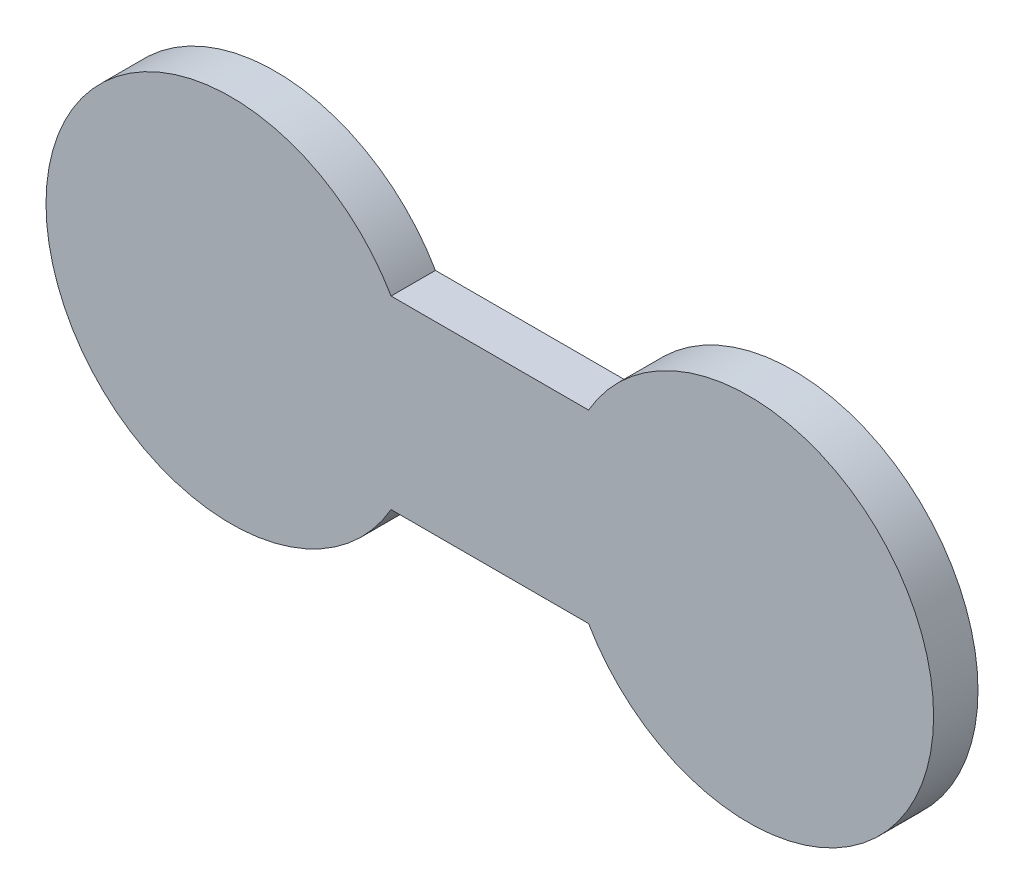
ISO-10303-21;
HEADER;
FILE_DESCRIPTION(('STEP AP214'),'2;1');
FILE_NAME('part.step','',(''),(''),'','','');
FILE_SCHEMA(('AUTOMOTIVE_DESIGN { 1 0 10303 214 1 1 1 1 }'));
ENDSEC;
DATA;
#1=APPLICATION_CONTEXT('core data for automotive mechanical design processes');
#2=APPLICATION_PROTOCOL_DEFINITION('international standard','automotive_design',2000,#1);
#3=PRODUCT_CONTEXT('',#1,'mechanical');
#4=PRODUCT('Part','Part','',(#3));
#5=PRODUCT_RELATED_PRODUCT_CATEGORY('part','',(#4));
#6=PRODUCT_DEFINITION_FORMATION('','',#4);
#7=PRODUCT_DEFINITION_CONTEXT('part definition',#1,'design');
#8=PRODUCT_DEFINITION('design','',#6,#7);
#9=PRODUCT_DEFINITION_SHAPE('','',#8);
#10=(LENGTH_UNIT() NAMED_UNIT(*) SI_UNIT(.MILLI.,.METRE.));
#11=(NAMED_UNIT(*) PLANE_ANGLE_UNIT() SI_UNIT($,.RADIAN.));
#12=(NAMED_UNIT(*) SI_UNIT($,.STERADIAN.) SOLID_ANGLE_UNIT());
#13=UNCERTAINTY_MEASURE_WITH_UNIT(LENGTH_MEASURE(1.E-05),#10,'distance_accuracy_value','');
#14=(GEOMETRIC_REPRESENTATION_CONTEXT(3) GLOBAL_UNCERTAINTY_ASSIGNED_CONTEXT((#13)) GLOBAL_UNIT_ASSIGNED_CONTEXT((#10,
#11,#12)) REPRESENTATION_CONTEXT('',''));
#15=CARTESIAN_POINT('',(0.,0.,0.));
#16=DIRECTION('',(0.,0.,1.));
#17=DIRECTION('',(1.,0.,0.));
#18=AXIS2_PLACEMENT_3D('',#15,#16,#17);
#19=CARTESIAN_POINT('',(0.,0.,3.));
#20=DIRECTION('',(0.,0.,-1.));
#21=DIRECTION('',(-1.,0.,0.));
#22=AXIS2_PLACEMENT_3D('',#19,#20,#21);
#23=PLANE('',#22);
#24=DIRECTION('',(1.,0.,0.));
#25=VECTOR('',#24,1.);
#26=CARTESIAN_POINT('',(0.,-6.25,3.));
#27=LINE('',#26,#25);
#28=CARTESIAN_POINT('',(-6.6746824526945,-6.25,3.));
#29=VERTEX_POINT('',#28);
#30=CARTESIAN_POINT('',(6.67468245269451,-6.25,3.));
#31=VERTEX_POINT('',#30);
#32=EDGE_CURVE('E191',#29,#31,#27,.T.);
#33=ORIENTED_EDGE('',*,*,#32,.T.);
#34=CARTESIAN_POINT('',(17.5,0.,3.));
#35=DIRECTION('',(0.,0.,1.));
#36=DIRECTION('',(1.,0.,0.));
#37=AXIS2_PLACEMENT_3D('',#34,#35,#36);
#38=CIRCLE('',#37,12.5);
#39=CARTESIAN_POINT('',(6.67468245269451,6.25,3.));
#40=VERTEX_POINT('',#39);
#41=EDGE_CURVE('E174',#40,#31,#38,.F.);
#42=ORIENTED_EDGE('',*,*,#41,.F.);
#43=DIRECTION('',(1.,0.,0.));
#44=VECTOR('',#43,1.);
#45=CARTESIAN_POINT('',(0.,6.25,3.));
#46=LINE('',#45,#44);
#47=CARTESIAN_POINT('',(-6.67468245269451,6.25,3.));
#48=VERTEX_POINT('',#47);
#49=EDGE_CURVE('E184',#48,#40,#46,.T.);
#50=ORIENTED_EDGE('',*,*,#49,.F.);
#51=CARTESIAN_POINT('',(-17.5,0.,3.));
#52=DIRECTION('',(0.,0.,1.));
#53=DIRECTION('',(1.,0.,0.));
#54=AXIS2_PLACEMENT_3D('',#51,#52,#53);
#55=CIRCLE('',#54,12.5);
#56=EDGE_CURVE('E183',#48,#29,#55,.T.);
#57=ORIENTED_EDGE('',*,*,#56,.T.);
#58=EDGE_LOOP('',(#33,#42,#50,#57));
#59=FACE_BOUND('',#58,.T.);
#60=ADVANCED_FACE('F135',(#59),#23,.F.);
#61=CARTESIAN_POINT('',(0.,0.,0.));
#62=DIRECTION('',(0.,0.,-1.));
#63=DIRECTION('',(-1.,0.,0.));
#64=AXIS2_PLACEMENT_3D('',#61,#62,#63);
#65=PLANE('',#64);
#66=CARTESIAN_POINT('',(17.5,0.,0.));
#67=DIRECTION('',(0.,0.,-1.));
#68=DIRECTION('',(-1.,0.,0.));
#69=AXIS2_PLACEMENT_3D('',#66,#67,#68);
#70=CIRCLE('',#69,12.5);
#71=CARTESIAN_POINT('',(6.67468245269451,-6.25,0.));
#72=VERTEX_POINT('',#71);
#73=CARTESIAN_POINT('',(6.67468245269451,6.25,0.));
#74=VERTEX_POINT('',#73);
#75=EDGE_CURVE('E158',#72,#74,#70,.F.);
#76=ORIENTED_EDGE('',*,*,#75,.F.);
#77=DIRECTION('',(-1.,0.,0.));
#78=VECTOR('',#77,1.);
#79=CARTESIAN_POINT('',(0.,-6.25,0.));
#80=LINE('',#79,#78);
#81=CARTESIAN_POINT('',(-6.6746824526945,-6.25,0.));
#82=VERTEX_POINT('',#81);
#83=EDGE_CURVE('E12',#72,#82,#80,.T.);
#84=ORIENTED_EDGE('',*,*,#83,.T.);
#85=CARTESIAN_POINT('',(-17.5,0.,0.));
#86=DIRECTION('',(0.,0.,-1.));
#87=DIRECTION('',(-1.,0.,0.));
#88=AXIS2_PLACEMENT_3D('',#85,#86,#87);
#89=CIRCLE('',#88,12.5);
#90=CARTESIAN_POINT('',(-6.67468245269451,6.25,0.));
#91=VERTEX_POINT('',#90);
#92=EDGE_CURVE('E143',#82,#91,#89,.T.);
#93=ORIENTED_EDGE('',*,*,#92,.T.);
#94=DIRECTION('',(-1.,0.,0.));
#95=VECTOR('',#94,1.);
#96=CARTESIAN_POINT('',(0.,6.25,0.));
#97=LINE('',#96,#95);
#98=EDGE_CURVE('E150',#74,#91,#97,.T.);
#99=ORIENTED_EDGE('',*,*,#98,.F.);
#100=EDGE_LOOP('',(#76,#84,#93,#99));
#101=FACE_BOUND('',#100,.T.);
#102=ADVANCED_FACE('F137',(#101),#65,.T.);
#103=CARTESIAN_POINT('',(0.,6.25,-7.));
#104=DIRECTION('',(0.,-1.,0.));
#105=DIRECTION('',(0.,0.,-1.));
#106=AXIS2_PLACEMENT_3D('',#103,#104,#105);
#107=PLANE('',#106);
#108=ORIENTED_EDGE('',*,*,#98,.T.);
#109=DIRECTION('',(0.,0.,1.));
#110=VECTOR('',#109,1.);
#111=CARTESIAN_POINT('',(-6.67468245269451,6.25,-7.));
#112=LINE('',#111,#110);
#113=EDGE_CURVE('E201',#91,#48,#112,.T.);
#114=ORIENTED_EDGE('',*,*,#113,.T.);
#115=ORIENTED_EDGE('',*,*,#49,.T.);
#116=DIRECTION('',(0.,0.,1.));
#117=VECTOR('',#116,1.);
#118=CARTESIAN_POINT('',(6.67468245269451,6.25,-7.));
#119=LINE('',#118,#117);
#120=EDGE_CURVE('E178',#74,#40,#119,.T.);
#121=ORIENTED_EDGE('',*,*,#120,.F.);
#122=EDGE_LOOP('',(#108,#114,#115,#121));
#123=FACE_BOUND('',#122,.T.);
#124=ADVANCED_FACE('F209',(#123),#107,.F.);
#125=CARTESIAN_POINT('',(-17.5,0.,-7.));
#126=DIRECTION('',(0.,0.,1.));
#127=DIRECTION('',(1.,0.,0.));
#128=AXIS2_PLACEMENT_3D('',#125,#126,#127);
#129=CYLINDRICAL_SURFACE('',#128,12.5);
#130=ORIENTED_EDGE('',*,*,#92,.F.);
#131=DIRECTION('',(0.,0.,1.));
#132=VECTOR('',#131,1.);
#133=CARTESIAN_POINT('',(-6.6746824526945,-6.25,-7.));
#134=LINE('',#133,#132);
#135=EDGE_CURVE('E192',#82,#29,#134,.T.);
#136=ORIENTED_EDGE('',*,*,#135,.T.);
#137=ORIENTED_EDGE('',*,*,#56,.F.);
#138=ORIENTED_EDGE('',*,*,#113,.F.);
#139=EDGE_LOOP('',(#130,#136,#137,#138));
#140=FACE_BOUND('',#139,.T.);
#141=ADVANCED_FACE('F208',(#140),#129,.T.);
#142=CARTESIAN_POINT('',(17.5,0.,-7.));
#143=DIRECTION('',(0.,0.,1.));
#144=DIRECTION('',(1.,0.,0.));
#145=AXIS2_PLACEMENT_3D('',#142,#143,#144);
#146=CYLINDRICAL_SURFACE('',#145,12.5);
#147=ORIENTED_EDGE('',*,*,#75,.T.);
#148=ORIENTED_EDGE('',*,*,#120,.T.);
#149=ORIENTED_EDGE('',*,*,#41,.T.);
#150=DIRECTION('',(0.,0.,1.));
#151=VECTOR('',#150,1.);
#152=CARTESIAN_POINT('',(6.67468245269451,-6.25,-7.));
#153=LINE('',#152,#151);
#154=EDGE_CURVE('E177',#72,#31,#153,.T.);
#155=ORIENTED_EDGE('',*,*,#154,.F.);
#156=EDGE_LOOP('',(#147,#148,#149,#155));
#157=FACE_BOUND('',#156,.T.);
#158=ADVANCED_FACE('F176',(#157),#146,.T.);
#159=CARTESIAN_POINT('',(0.,-6.25,-7.));
#160=DIRECTION('',(0.,-1.,0.));
#161=DIRECTION('',(0.,0.,-1.));
#162=AXIS2_PLACEMENT_3D('',#159,#160,#161);
#163=PLANE('',#162);
#164=ORIENTED_EDGE('',*,*,#154,.T.);
#165=ORIENTED_EDGE('',*,*,#32,.F.);
#166=ORIENTED_EDGE('',*,*,#135,.F.);
#167=ORIENTED_EDGE('',*,*,#83,.F.);
#168=EDGE_LOOP('',(#164,#165,#166,#167));
#169=FACE_BOUND('',#168,.T.);
#170=ADVANCED_FACE('F189',(#169),#163,.T.);
#171=CLOSED_SHELL('',(#60,#102,#124,#141,#158,#170));
#172=MANIFOLD_SOLID_BREP('B2',#171);
#173=ADVANCED_BREP_SHAPE_REPRESENTATION('',(#18,#172),#14);
#174=SHAPE_DEFINITION_REPRESENTATION(#9,#173);
ENDSEC;
END-ISO-10303-21;
